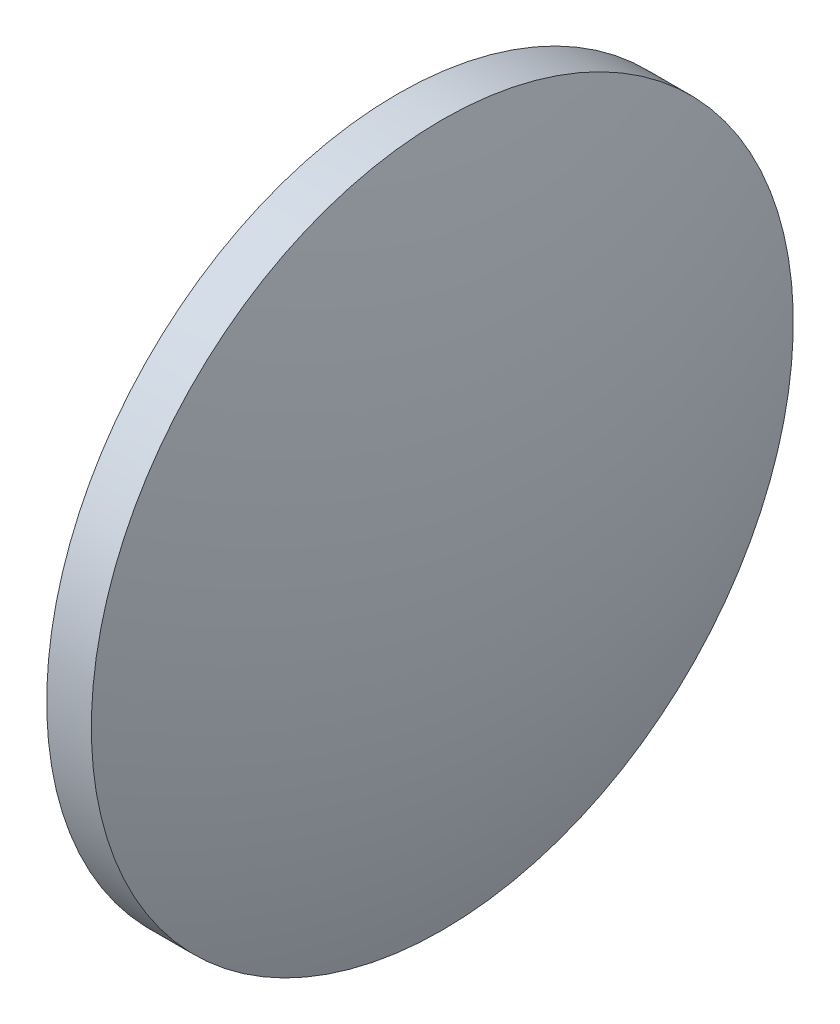
ISO-10303-21;
HEADER;
FILE_DESCRIPTION(('STEP AP214'),'2;1');
FILE_NAME('part.step','',(''),(''),'','','');
FILE_SCHEMA(('AUTOMOTIVE_DESIGN { 1 0 10303 214 1 1 1 1 }'));
ENDSEC;
DATA;
#1=APPLICATION_CONTEXT('core data for automotive mechanical design processes');
#2=APPLICATION_PROTOCOL_DEFINITION('international standard','automotive_design',2000,#1);
#3=PRODUCT_CONTEXT('',#1,'mechanical');
#4=PRODUCT('Part','Part','',(#3));
#5=PRODUCT_RELATED_PRODUCT_CATEGORY('part','',(#4));
#6=PRODUCT_DEFINITION_FORMATION('','',#4);
#7=PRODUCT_DEFINITION_CONTEXT('part definition',#1,'design');
#8=PRODUCT_DEFINITION('design','',#6,#7);
#9=PRODUCT_DEFINITION_SHAPE('','',#8);
#10=(LENGTH_UNIT() NAMED_UNIT(*) SI_UNIT(.MILLI.,.METRE.));
#11=(NAMED_UNIT(*) PLANE_ANGLE_UNIT() SI_UNIT($,.RADIAN.));
#12=(NAMED_UNIT(*) SI_UNIT($,.STERADIAN.) SOLID_ANGLE_UNIT());
#13=UNCERTAINTY_MEASURE_WITH_UNIT(LENGTH_MEASURE(1.E-05),#10,'distance_accuracy_value','');
#14=(GEOMETRIC_REPRESENTATION_CONTEXT(3) GLOBAL_UNCERTAINTY_ASSIGNED_CONTEXT((#13)) GLOBAL_UNIT_ASSIGNED_CONTEXT((#10,
#11,#12)) REPRESENTATION_CONTEXT('',''));
#15=CARTESIAN_POINT('',(0.,0.,0.));
#16=DIRECTION('',(0.,0.,1.));
#17=DIRECTION('',(1.,0.,0.));
#18=AXIS2_PLACEMENT_3D('',#15,#16,#17);
#19=CARTESIAN_POINT('',(123.285784244651,47.8505049440793,0.));
#20=DIRECTION('',(-1.,0.,0.));
#21=DIRECTION('',(0.,1.,0.));
#22=AXIS2_PLACEMENT_3D('',#19,#20,#21);
#23=SPHERICAL_SURFACE('',#22,40.9391368286448);
#24=CARTESIAN_POINT('',(84.3016474160061,47.8505049440794,0.));
#25=DIRECTION('',(-1.,0.,0.));
#26=DIRECTION('',(0.,-1.,0.));
#27=AXIS2_PLACEMENT_3D('',#24,#25,#26);
#28=CIRCLE('',#27,12.5);
#29=CARTESIAN_POINT('',(84.3016474160061,35.3505049440794,0.));
#30=VERTEX_POINT('',#29);
#31=EDGE_CURVE('E46',#30,#30,#28,.T.);
#32=ORIENTED_EDGE('',*,*,#31,.T.);
#33=EDGE_LOOP('',(#32));
#34=FACE_BOUND('',#33,.T.);
#35=ADVANCED_FACE('F39',(#34),#23,.T.);
#36=CARTESIAN_POINT('',(46.9075105873617,47.8505049440793,0.));
#37=DIRECTION('',(-1.,0.,0.));
#38=DIRECTION('',(0.,1.,0.));
#39=AXIS2_PLACEMENT_3D('',#36,#37,#38);
#40=SPHERICAL_SURFACE('',#39,40.9391368286445);
#41=CARTESIAN_POINT('',(85.8916474160062,47.8505049440794,0.));
#42=DIRECTION('',(-1.,0.,0.));
#43=DIRECTION('',(0.,-1.,0.));
#44=AXIS2_PLACEMENT_3D('',#41,#42,#43);
#45=CIRCLE('',#44,12.5);
#46=CARTESIAN_POINT('',(85.8916474160061,35.3505049440794,0.));
#47=VERTEX_POINT('',#46);
#48=EDGE_CURVE('E10',#47,#47,#45,.T.);
#49=ORIENTED_EDGE('',*,*,#48,.F.);
#50=EDGE_LOOP('',(#49));
#51=FACE_BOUND('',#50,.T.);
#52=ADVANCED_FACE('F56',(#51),#40,.T.);
#53=CARTESIAN_POINT('',(81.2129699127501,47.8505049440794,0.));
#54=DIRECTION('',(-1.,0.,0.));
#55=DIRECTION('',(0.,-1.,0.));
#56=AXIS2_PLACEMENT_3D('',#53,#54,#55);
#57=CYLINDRICAL_SURFACE('',#56,12.5);
#58=ORIENTED_EDGE('',*,*,#48,.T.);
#59=EDGE_LOOP('',(#58));
#60=FACE_BOUND('',#59,.T.);
#61=ORIENTED_EDGE('',*,*,#31,.F.);
#62=EDGE_LOOP('',(#61));
#63=FACE_BOUND('',#62,.T.);
#64=ADVANCED_FACE('F54',(#60,#63),#57,.T.);
#65=CLOSED_SHELL('',(#35,#52,#64));
#66=MANIFOLD_SOLID_BREP('B2',#65);
#67=ADVANCED_BREP_SHAPE_REPRESENTATION('',(#18,#66),#14);
#68=SHAPE_DEFINITION_REPRESENTATION(#9,#67);
ENDSEC;
END-ISO-10303-21;
